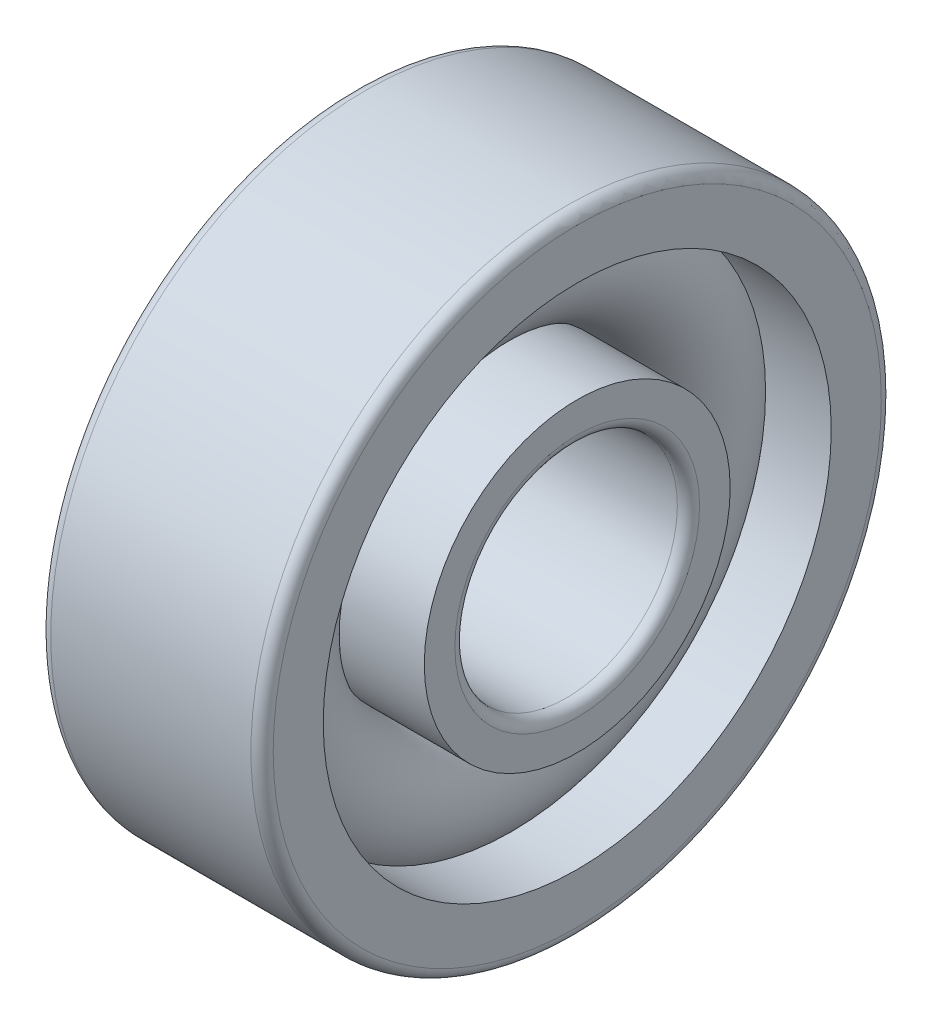
ISO-10303-21;
HEADER;
FILE_DESCRIPTION(('STEP AP214'),'2;1');
FILE_NAME('part.step','',(''),(''),'','','');
FILE_SCHEMA(('AUTOMOTIVE_DESIGN { 1 0 10303 214 1 1 1 1 }'));
ENDSEC;
DATA;
#1=APPLICATION_CONTEXT('core data for automotive mechanical design processes');
#2=APPLICATION_PROTOCOL_DEFINITION('international standard','automotive_design',2000,#1);
#3=PRODUCT_CONTEXT('',#1,'mechanical');
#4=PRODUCT('Part','Part','',(#3));
#5=PRODUCT_RELATED_PRODUCT_CATEGORY('part','',(#4));
#6=PRODUCT_DEFINITION_FORMATION('','',#4);
#7=PRODUCT_DEFINITION_CONTEXT('part definition',#1,'design');
#8=PRODUCT_DEFINITION('design','',#6,#7);
#9=PRODUCT_DEFINITION_SHAPE('','',#8);
#10=(LENGTH_UNIT() NAMED_UNIT(*) SI_UNIT(.MILLI.,.METRE.));
#11=(NAMED_UNIT(*) PLANE_ANGLE_UNIT() SI_UNIT($,.RADIAN.));
#12=(NAMED_UNIT(*) SI_UNIT($,.STERADIAN.) SOLID_ANGLE_UNIT());
#13=UNCERTAINTY_MEASURE_WITH_UNIT(LENGTH_MEASURE(1.E-05),#10,'distance_accuracy_value','');
#14=(GEOMETRIC_REPRESENTATION_CONTEXT(3) GLOBAL_UNCERTAINTY_ASSIGNED_CONTEXT((#13)) GLOBAL_UNIT_ASSIGNED_CONTEXT((#10,
#11,#12)) REPRESENTATION_CONTEXT('',''));
#15=CARTESIAN_POINT('',(0.,0.,0.));
#16=DIRECTION('',(0.,0.,1.));
#17=DIRECTION('',(1.,0.,0.));
#18=AXIS2_PLACEMENT_3D('',#15,#16,#17);
#19=CARTESIAN_POINT('',(0.,0.,0.));
#20=DIRECTION('',(-1.,0.,0.));
#21=DIRECTION('',(0.,0.,1.));
#22=AXIS2_PLACEMENT_3D('',#19,#20,#21);
#23=TOROIDAL_SURFACE('',#22,5.75,1.65);
#24=CARTESIAN_POINT('',(1.22983738762489,0.,0.));
#25=DIRECTION('',(-1.,0.,0.));
#26=DIRECTION('',(0.,0.,1.));
#27=AXIS2_PLACEMENT_3D('',#24,#25,#26);
#28=CIRCLE('',#27,6.85);
#29=CARTESIAN_POINT('',(1.22983738762489,0.,6.85));
#30=VERTEX_POINT('',#29);
#31=EDGE_CURVE('E34',#30,#30,#28,.F.);
#32=ORIENTED_EDGE('',*,*,#31,.T.);
#33=EDGE_LOOP('',(#32));
#34=FACE_BOUND('',#33,.T.);
#35=CARTESIAN_POINT('',(0.286138078556493,0.,0.));
#36=DIRECTION('',(-1.,0.,0.));
#37=DIRECTION('',(0.,0.,1.));
#38=AXIS2_PLACEMENT_3D('',#35,#36,#37);
#39=CIRCLE('',#38,4.125);
#40=CARTESIAN_POINT('',(0.286138078556493,0.,4.125));
#41=VERTEX_POINT('',#40);
#42=EDGE_CURVE('E10',#41,#41,#39,.T.);
#43=ORIENTED_EDGE('',*,*,#42,.T.);
#44=EDGE_LOOP('',(#43));
#45=FACE_BOUND('',#44,.T.);
#46=ADVANCED_FACE('F30',(#34,#45),#23,.T.);
#47=CARTESIAN_POINT('',(-20.6375,0.,0.));
#48=DIRECTION('',(1.,0.,0.));
#49=DIRECTION('',(0.,0.,-1.));
#50=AXIS2_PLACEMENT_3D('',#47,#48,#49);
#51=CYLINDRICAL_SURFACE('',#50,4.125);
#52=CARTESIAN_POINT('',(3.,0.,0.));
#53=DIRECTION('',(1.,0.,0.));
#54=DIRECTION('',(0.,0.,-1.));
#55=AXIS2_PLACEMENT_3D('',#52,#53,#54);
#56=CIRCLE('',#55,4.125);
#57=CARTESIAN_POINT('',(3.,0.,-4.125));
#58=VERTEX_POINT('',#57);
#59=EDGE_CURVE('E43',#58,#58,#56,.T.);
#60=ORIENTED_EDGE('',*,*,#59,.F.);
#61=EDGE_LOOP('',(#60));
#62=FACE_BOUND('',#61,.T.);
#63=ORIENTED_EDGE('',*,*,#42,.F.);
#64=EDGE_LOOP('',(#63));
#65=FACE_BOUND('',#64,.T.);
#66=ADVANCED_FACE('F82',(#62,#65),#51,.T.);
#67=CARTESIAN_POINT('',(-20.6375,0.,0.));
#68=DIRECTION('',(1.,0.,0.));
#69=DIRECTION('',(0.,0.,-1.));
#70=AXIS2_PLACEMENT_3D('',#67,#68,#69);
#71=CYLINDRICAL_SURFACE('',#70,4.65);
#72=CARTESIAN_POINT('',(-3.,0.,0.));
#73=DIRECTION('',(1.,0.,0.));
#74=DIRECTION('',(0.,0.,-1.));
#75=AXIS2_PLACEMENT_3D('',#72,#73,#74);
#76=CIRCLE('',#75,4.65);
#77=CARTESIAN_POINT('',(-3.,0.,-4.65));
#78=VERTEX_POINT('',#77);
#79=EDGE_CURVE('E52',#78,#78,#76,.T.);
#80=ORIENTED_EDGE('',*,*,#79,.T.);
#81=EDGE_LOOP('',(#80));
#82=FACE_BOUND('',#81,.T.);
#83=CARTESIAN_POINT('',(-1.22983738762488,0.,0.));
#84=DIRECTION('',(1.,0.,0.));
#85=DIRECTION('',(0.,0.,-1.));
#86=AXIS2_PLACEMENT_3D('',#83,#84,#85);
#87=CIRCLE('',#86,4.65);
#88=CARTESIAN_POINT('',(-1.22983738762488,0.,-4.65));
#89=VERTEX_POINT('',#88);
#90=EDGE_CURVE('E38',#89,#89,#87,.T.);
#91=ORIENTED_EDGE('',*,*,#90,.F.);
#92=EDGE_LOOP('',(#91));
#93=FACE_BOUND('',#92,.T.);
#94=ADVANCED_FACE('F85',(#82,#93),#71,.T.);
#95=CARTESIAN_POINT('',(3.,3.3,0.));
#96=DIRECTION('',(1.,0.,0.));
#97=DIRECTION('',(0.,0.,-1.));
#98=AXIS2_PLACEMENT_3D('',#95,#96,#97);
#99=PLANE('',#98);
#100=ORIENTED_EDGE('',*,*,#59,.T.);
#101=EDGE_LOOP('',(#100));
#102=FACE_BOUND('',#101,.T.);
#103=CARTESIAN_POINT('',(3.,0.,0.));
#104=DIRECTION('',(1.,0.,0.));
#105=DIRECTION('',(0.,0.,-1.));
#106=AXIS2_PLACEMENT_3D('',#103,#104,#105);
#107=CIRCLE('',#106,3.3);
#108=CARTESIAN_POINT('',(3.,0.,-3.3));
#109=VERTEX_POINT('',#108);
#110=EDGE_CURVE('E74',#109,#109,#107,.T.);
#111=ORIENTED_EDGE('',*,*,#110,.F.);
#112=EDGE_LOOP('',(#111));
#113=FACE_BOUND('',#112,.T.);
#114=ADVANCED_FACE('F79',(#102,#113),#99,.T.);
#115=CARTESIAN_POINT('',(2.7,0.,0.));
#116=DIRECTION('',(1.,0.,0.));
#117=DIRECTION('',(0.,0.,-1.));
#118=AXIS2_PLACEMENT_3D('',#115,#116,#117);
#119=TOROIDAL_SURFACE('',#118,3.3,0.3);
#120=ORIENTED_EDGE('',*,*,#110,.T.);
#121=EDGE_LOOP('',(#120));
#122=FACE_BOUND('',#121,.T.);
#123=CARTESIAN_POINT('',(2.7,0.,0.));
#124=DIRECTION('',(1.,0.,0.));
#125=DIRECTION('',(0.,0.,-1.));
#126=AXIS2_PLACEMENT_3D('',#123,#124,#125);
#127=CIRCLE('',#126,3.);
#128=CARTESIAN_POINT('',(2.7,0.,-3.));
#129=VERTEX_POINT('',#128);
#130=EDGE_CURVE('E71',#129,#129,#127,.T.);
#131=ORIENTED_EDGE('',*,*,#130,.F.);
#132=EDGE_LOOP('',(#131));
#133=FACE_BOUND('',#132,.T.);
#134=ADVANCED_FACE('F96',(#122,#133),#119,.T.);
#135=CARTESIAN_POINT('',(-20.6375,0.,0.));
#136=DIRECTION('',(1.,0.,0.));
#137=DIRECTION('',(0.,0.,-1.));
#138=AXIS2_PLACEMENT_3D('',#135,#136,#137);
#139=CYLINDRICAL_SURFACE('',#138,3.);
#140=ORIENTED_EDGE('',*,*,#130,.T.);
#141=EDGE_LOOP('',(#140));
#142=FACE_BOUND('',#141,.T.);
#143=CARTESIAN_POINT('',(-2.7,0.,0.));
#144=DIRECTION('',(1.,0.,0.));
#145=DIRECTION('',(0.,0.,-1.));
#146=AXIS2_PLACEMENT_3D('',#143,#144,#145);
#147=CIRCLE('',#146,3.);
#148=CARTESIAN_POINT('',(-2.7,0.,-3.));
#149=VERTEX_POINT('',#148);
#150=EDGE_CURVE('E68',#149,#149,#147,.T.);
#151=ORIENTED_EDGE('',*,*,#150,.F.);
#152=EDGE_LOOP('',(#151));
#153=FACE_BOUND('',#152,.T.);
#154=ADVANCED_FACE('F99',(#142,#153),#139,.F.);
#155=CARTESIAN_POINT('',(-2.7,0.,0.));
#156=DIRECTION('',(1.,0.,0.));
#157=DIRECTION('',(0.,0.,-1.));
#158=AXIS2_PLACEMENT_3D('',#155,#156,#157);
#159=TOROIDAL_SURFACE('',#158,3.3,0.3);
#160=ORIENTED_EDGE('',*,*,#150,.T.);
#161=EDGE_LOOP('',(#160));
#162=FACE_BOUND('',#161,.T.);
#163=CARTESIAN_POINT('',(-3.,0.,0.));
#164=DIRECTION('',(1.,0.,0.));
#165=DIRECTION('',(0.,0.,-1.));
#166=AXIS2_PLACEMENT_3D('',#163,#164,#165);
#167=CIRCLE('',#166,3.3);
#168=CARTESIAN_POINT('',(-3.,0.,-3.3));
#169=VERTEX_POINT('',#168);
#170=EDGE_CURVE('E65',#169,#169,#167,.T.);
#171=ORIENTED_EDGE('',*,*,#170,.F.);
#172=EDGE_LOOP('',(#171));
#173=FACE_BOUND('',#172,.T.);
#174=ADVANCED_FACE('F103',(#162,#173),#159,.T.);
#175=CARTESIAN_POINT('',(-3.,4.65,0.));
#176=DIRECTION('',(-1.,0.,0.));
#177=DIRECTION('',(0.,0.,1.));
#178=AXIS2_PLACEMENT_3D('',#175,#176,#177);
#179=PLANE('',#178);
#180=ORIENTED_EDGE('',*,*,#170,.T.);
#181=EDGE_LOOP('',(#180));
#182=FACE_BOUND('',#181,.T.);
#183=ORIENTED_EDGE('',*,*,#79,.F.);
#184=EDGE_LOOP('',(#183));
#185=FACE_BOUND('',#184,.T.);
#186=ADVANCED_FACE('F107',(#182,#185),#179,.T.);
#187=CARTESIAN_POINT('',(-0.286138078556493,0.,0.));
#188=DIRECTION('',(1.,0.,0.));
#189=DIRECTION('',(0.,0.,-1.));
#190=AXIS2_PLACEMENT_3D('',#187,#188,#189);
#191=CIRCLE('',#190,7.375);
#192=CARTESIAN_POINT('',(-0.286138078556493,0.,-7.375));
#193=VERTEX_POINT('',#192);
#194=EDGE_CURVE('E46',#193,#193,#191,.F.);
#195=ORIENTED_EDGE('',*,*,#194,.T.);
#196=EDGE_LOOP('',(#195));
#197=FACE_BOUND('',#196,.T.);
#198=ORIENTED_EDGE('',*,*,#90,.T.);
#199=EDGE_LOOP('',(#198));
#200=FACE_BOUND('',#199,.T.);
#201=ADVANCED_FACE('F32',(#197,#200),#23,.T.);
#202=CARTESIAN_POINT('',(-20.6375,0.,0.));
#203=DIRECTION('',(1.,0.,0.));
#204=DIRECTION('',(0.,0.,-1.));
#205=AXIS2_PLACEMENT_3D('',#202,#203,#204);
#206=CYLINDRICAL_SURFACE('',#205,6.85);
#207=CARTESIAN_POINT('',(3.,0.,0.));
#208=DIRECTION('',(1.,0.,0.));
#209=DIRECTION('',(0.,0.,-1.));
#210=AXIS2_PLACEMENT_3D('',#207,#208,#209);
#211=CIRCLE('',#210,6.85);
#212=CARTESIAN_POINT('',(3.,0.,-6.85));
#213=VERTEX_POINT('',#212);
#214=EDGE_CURVE('E148',#213,#213,#211,.T.);
#215=ORIENTED_EDGE('',*,*,#214,.T.);
#216=EDGE_LOOP('',(#215));
#217=FACE_BOUND('',#216,.T.);
#218=ORIENTED_EDGE('',*,*,#31,.F.);
#219=EDGE_LOOP('',(#218));
#220=FACE_BOUND('',#219,.T.);
#221=ADVANCED_FACE('F129',(#217,#220),#206,.F.);
#222=CARTESIAN_POINT('',(-20.6375,0.,0.));
#223=DIRECTION('',(1.,0.,0.));
#224=DIRECTION('',(0.,0.,-1.));
#225=AXIS2_PLACEMENT_3D('',#222,#223,#224);
#226=CYLINDRICAL_SURFACE('',#225,7.375);
#227=CARTESIAN_POINT('',(-3.,0.,0.));
#228=DIRECTION('',(1.,0.,0.));
#229=DIRECTION('',(0.,0.,-1.));
#230=AXIS2_PLACEMENT_3D('',#227,#228,#229);
#231=CIRCLE('',#230,7.375);
#232=CARTESIAN_POINT('',(-3.,0.,-7.375));
#233=VERTEX_POINT('',#232);
#234=EDGE_CURVE('E143',#233,#233,#231,.T.);
#235=ORIENTED_EDGE('',*,*,#234,.F.);
#236=EDGE_LOOP('',(#235));
#237=FACE_BOUND('',#236,.T.);
#238=ORIENTED_EDGE('',*,*,#194,.F.);
#239=EDGE_LOOP('',(#238));
#240=FACE_BOUND('',#239,.T.);
#241=ADVANCED_FACE('F116',(#237,#240),#226,.F.);
#242=CARTESIAN_POINT('',(-2.7,0.,0.));
#243=DIRECTION('',(1.,0.,0.));
#244=DIRECTION('',(0.,0.,-1.));
#245=AXIS2_PLACEMENT_3D('',#242,#243,#244);
#246=TOROIDAL_SURFACE('',#245,8.2,0.3);
#247=CARTESIAN_POINT('',(-3.,0.,0.));
#248=DIRECTION('',(1.,0.,0.));
#249=DIRECTION('',(0.,0.,-1.));
#250=AXIS2_PLACEMENT_3D('',#247,#248,#249);
#251=CIRCLE('',#250,8.2);
#252=CARTESIAN_POINT('',(-3.,0.,-8.2));
#253=VERTEX_POINT('',#252);
#254=EDGE_CURVE('E146',#253,#253,#251,.T.);
#255=ORIENTED_EDGE('',*,*,#254,.T.);
#256=EDGE_LOOP('',(#255));
#257=FACE_BOUND('',#256,.T.);
#258=CARTESIAN_POINT('',(-2.7,0.,0.));
#259=DIRECTION('',(1.,0.,0.));
#260=DIRECTION('',(0.,0.,-1.));
#261=AXIS2_PLACEMENT_3D('',#258,#259,#260);
#262=CIRCLE('',#261,8.5);
#263=CARTESIAN_POINT('',(-2.7,0.,-8.5));
#264=VERTEX_POINT('',#263);
#265=EDGE_CURVE('E48',#264,#264,#262,.T.);
#266=ORIENTED_EDGE('',*,*,#265,.F.);
#267=EDGE_LOOP('',(#266));
#268=FACE_BOUND('',#267,.T.);
#269=ADVANCED_FACE('F112',(#257,#268),#246,.T.);
#270=CARTESIAN_POINT('',(-20.6375,0.,0.));
#271=DIRECTION('',(1.,0.,0.));
#272=DIRECTION('',(0.,0.,-1.));
#273=AXIS2_PLACEMENT_3D('',#270,#271,#272);
#274=CYLINDRICAL_SURFACE('',#273,8.5);
#275=ORIENTED_EDGE('',*,*,#265,.T.);
#276=EDGE_LOOP('',(#275));
#277=FACE_BOUND('',#276,.T.);
#278=CARTESIAN_POINT('',(2.7,0.,0.));
#279=DIRECTION('',(1.,0.,0.));
#280=DIRECTION('',(0.,0.,-1.));
#281=AXIS2_PLACEMENT_3D('',#278,#279,#280);
#282=CIRCLE('',#281,8.5);
#283=CARTESIAN_POINT('',(2.7,0.,-8.5));
#284=VERTEX_POINT('',#283);
#285=EDGE_CURVE('E54',#284,#284,#282,.T.);
#286=ORIENTED_EDGE('',*,*,#285,.F.);
#287=EDGE_LOOP('',(#286));
#288=FACE_BOUND('',#287,.T.);
#289=ADVANCED_FACE('F115',(#277,#288),#274,.T.);
#290=CARTESIAN_POINT('',(2.7,0.,0.));
#291=DIRECTION('',(1.,0.,0.));
#292=DIRECTION('',(0.,0.,-1.));
#293=AXIS2_PLACEMENT_3D('',#290,#291,#292);
#294=TOROIDAL_SURFACE('',#293,8.2,0.3);
#295=ORIENTED_EDGE('',*,*,#285,.T.);
#296=EDGE_LOOP('',(#295));
#297=FACE_BOUND('',#296,.T.);
#298=CARTESIAN_POINT('',(3.,0.,0.));
#299=DIRECTION('',(1.,0.,0.));
#300=DIRECTION('',(0.,0.,-1.));
#301=AXIS2_PLACEMENT_3D('',#298,#299,#300);
#302=CIRCLE('',#301,8.2);
#303=CARTESIAN_POINT('',(3.,0.,-8.2));
#304=VERTEX_POINT('',#303);
#305=EDGE_CURVE('E59',#304,#304,#302,.T.);
#306=ORIENTED_EDGE('',*,*,#305,.F.);
#307=EDGE_LOOP('',(#306));
#308=FACE_BOUND('',#307,.T.);
#309=ADVANCED_FACE('F120',(#297,#308),#294,.T.);
#310=CARTESIAN_POINT('',(3.,8.2,0.));
#311=DIRECTION('',(1.,0.,0.));
#312=DIRECTION('',(0.,0.,-1.));
#313=AXIS2_PLACEMENT_3D('',#310,#311,#312);
#314=PLANE('',#313);
#315=ORIENTED_EDGE('',*,*,#305,.T.);
#316=EDGE_LOOP('',(#315));
#317=FACE_BOUND('',#316,.T.);
#318=ORIENTED_EDGE('',*,*,#214,.F.);
#319=EDGE_LOOP('',(#318));
#320=FACE_BOUND('',#319,.T.);
#321=ADVANCED_FACE('F123',(#317,#320),#314,.T.);
#322=CARTESIAN_POINT('',(-3.,7.375,0.));
#323=DIRECTION('',(-1.,0.,0.));
#324=DIRECTION('',(0.,0.,1.));
#325=AXIS2_PLACEMENT_3D('',#322,#323,#324);
#326=PLANE('',#325);
#327=ORIENTED_EDGE('',*,*,#234,.T.);
#328=EDGE_LOOP('',(#327));
#329=FACE_BOUND('',#328,.T.);
#330=ORIENTED_EDGE('',*,*,#254,.F.);
#331=EDGE_LOOP('',(#330));
#332=FACE_BOUND('',#331,.T.);
#333=ADVANCED_FACE('F127',(#329,#332),#326,.T.);
#334=CLOSED_SHELL('',(#46,#66,#94,#114,#134,#154,#174,#186,#201,#221,#241,#269,#289,#309,#321,#333));
#335=MANIFOLD_SOLID_BREP('B2',#334);
#336=ADVANCED_BREP_SHAPE_REPRESENTATION('',(#18,#335),#14);
#337=SHAPE_DEFINITION_REPRESENTATION(#9,#336);
ENDSEC;
END-ISO-10303-21;
